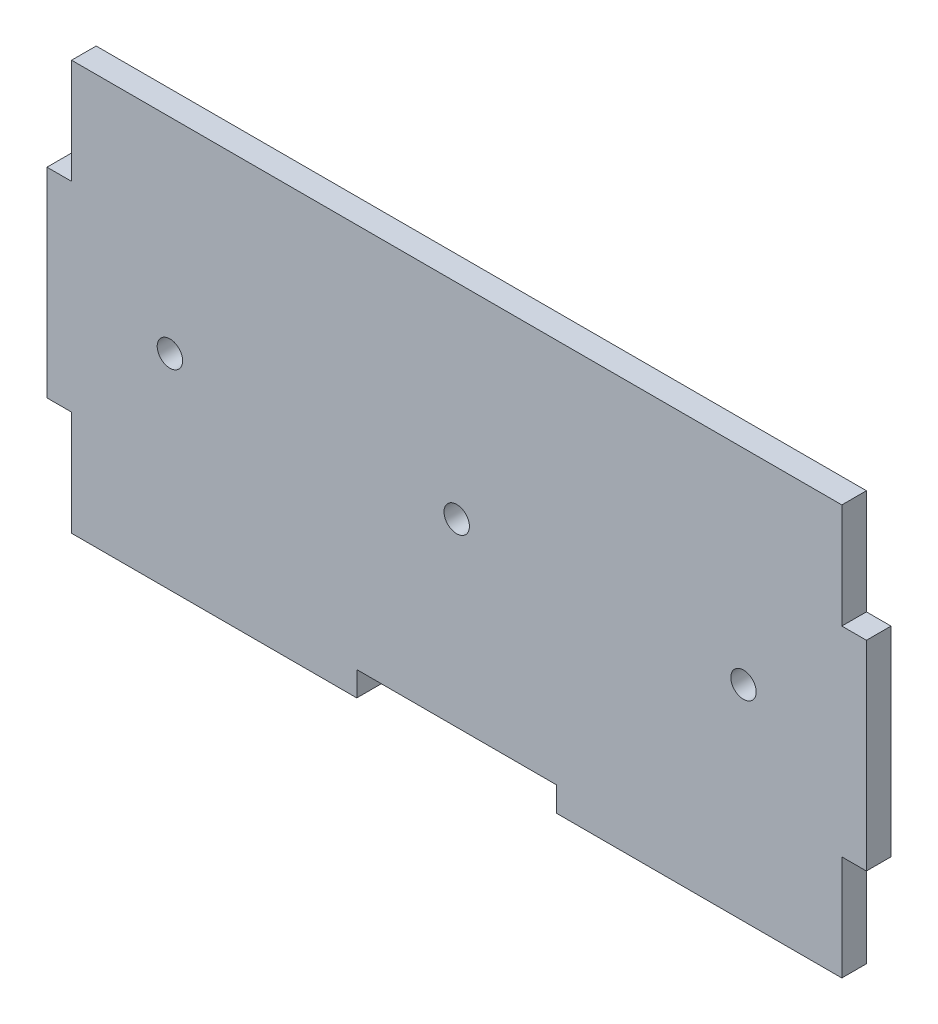
ISO-10303-21;
HEADER;
FILE_DESCRIPTION(('STEP AP214'),'2;1');
FILE_NAME('part.step','',(''),(''),'','','');
FILE_SCHEMA(('AUTOMOTIVE_DESIGN { 1 0 10303 214 1 1 1 1 }'));
ENDSEC;
DATA;
#1=APPLICATION_CONTEXT('core data for automotive mechanical design processes');
#2=APPLICATION_PROTOCOL_DEFINITION('international standard','automotive_design',2000,#1);
#3=PRODUCT_CONTEXT('',#1,'mechanical');
#4=PRODUCT('Part','Part','',(#3));
#5=PRODUCT_RELATED_PRODUCT_CATEGORY('part','',(#4));
#6=PRODUCT_DEFINITION_FORMATION('','',#4);
#7=PRODUCT_DEFINITION_CONTEXT('part definition',#1,'design');
#8=PRODUCT_DEFINITION('design','',#6,#7);
#9=PRODUCT_DEFINITION_SHAPE('','',#8);
#10=(LENGTH_UNIT() NAMED_UNIT(*) SI_UNIT(.MILLI.,.METRE.));
#11=(NAMED_UNIT(*) PLANE_ANGLE_UNIT() SI_UNIT($,.RADIAN.));
#12=(NAMED_UNIT(*) SI_UNIT($,.STERADIAN.) SOLID_ANGLE_UNIT());
#13=UNCERTAINTY_MEASURE_WITH_UNIT(LENGTH_MEASURE(1.E-05),#10,'distance_accuracy_value','');
#14=(GEOMETRIC_REPRESENTATION_CONTEXT(3) GLOBAL_UNCERTAINTY_ASSIGNED_CONTEXT((#13)) GLOBAL_UNIT_ASSIGNED_CONTEXT((#10,
#11,#12)) REPRESENTATION_CONTEXT('',''));
#15=CARTESIAN_POINT('',(0.,0.,0.));
#16=DIRECTION('',(0.,0.,1.));
#17=DIRECTION('',(1.,0.,0.));
#18=AXIS2_PLACEMENT_3D('',#15,#16,#17);
#19=CARTESIAN_POINT('',(280.,103.,3.));
#20=DIRECTION('',(0.,-1.,0.));
#21=DIRECTION('',(0.,0.,-1.));
#22=AXIS2_PLACEMENT_3D('',#19,#20,#21);
#23=PLANE('',#22);
#24=DIRECTION('',(-1.,0.,0.));
#25=VECTOR('',#24,1.);
#26=CARTESIAN_POINT('',(280.,103.,0.));
#27=LINE('',#26,#25);
#28=CARTESIAN_POINT('',(280.,103.,0.));
#29=VERTEX_POINT('',#28);
#30=CARTESIAN_POINT('',(186.,103.,0.));
#31=VERTEX_POINT('',#30);
#32=EDGE_CURVE('E178',#29,#31,#27,.T.);
#33=ORIENTED_EDGE('',*,*,#32,.T.);
#34=DIRECTION('',(0.,0.,-1.));
#35=VECTOR('',#34,1.);
#36=CARTESIAN_POINT('',(186.,103.,3.));
#37=LINE('',#36,#35);
#38=CARTESIAN_POINT('',(186.,103.,3.));
#39=VERTEX_POINT('',#38);
#40=EDGE_CURVE('E11',#39,#31,#37,.T.);
#41=ORIENTED_EDGE('',*,*,#40,.F.);
#42=DIRECTION('',(-1.,0.,0.));
#43=VECTOR('',#42,1.);
#44=CARTESIAN_POINT('',(280.,103.,3.));
#45=LINE('',#44,#43);
#46=CARTESIAN_POINT('',(280.,103.,3.));
#47=VERTEX_POINT('',#46);
#48=EDGE_CURVE('E209',#47,#39,#45,.T.);
#49=ORIENTED_EDGE('',*,*,#48,.F.);
#50=DIRECTION('',(0.,0.,-1.));
#51=VECTOR('',#50,1.);
#52=CARTESIAN_POINT('',(280.,103.,3.));
#53=LINE('',#52,#51);
#54=EDGE_CURVE('E174',#47,#29,#53,.T.);
#55=ORIENTED_EDGE('',*,*,#54,.T.);
#56=EDGE_LOOP('',(#33,#41,#49,#55));
#57=FACE_BOUND('',#56,.T.);
#58=ADVANCED_FACE('F32',(#57),#23,.F.);
#59=CARTESIAN_POINT('',(186.,103.,3.));
#60=DIRECTION('',(1.,0.,0.));
#61=DIRECTION('',(0.,0.,-1.));
#62=AXIS2_PLACEMENT_3D('',#59,#60,#61);
#63=PLANE('',#62);
#64=DIRECTION('',(0.,-1.,0.));
#65=VECTOR('',#64,1.);
#66=CARTESIAN_POINT('',(186.,103.,0.));
#67=LINE('',#66,#65);
#68=CARTESIAN_POINT('',(186.,90.195,0.));
#69=VERTEX_POINT('',#68);
#70=EDGE_CURVE('E181',#31,#69,#67,.T.);
#71=ORIENTED_EDGE('',*,*,#70,.T.);
#72=DIRECTION('',(0.,0.,-1.));
#73=VECTOR('',#72,1.);
#74=CARTESIAN_POINT('',(186.,90.195,3.));
#75=LINE('',#74,#73);
#76=CARTESIAN_POINT('',(186.,90.195,3.));
#77=VERTEX_POINT('',#76);
#78=EDGE_CURVE('E41',#77,#69,#75,.T.);
#79=ORIENTED_EDGE('',*,*,#78,.F.);
#80=DIRECTION('',(0.,-1.,0.));
#81=VECTOR('',#80,1.);
#82=CARTESIAN_POINT('',(186.,103.,3.));
#83=LINE('',#82,#81);
#84=EDGE_CURVE('E117',#39,#77,#83,.T.);
#85=ORIENTED_EDGE('',*,*,#84,.F.);
#86=ORIENTED_EDGE('',*,*,#40,.T.);
#87=EDGE_LOOP('',(#71,#79,#85,#86));
#88=FACE_BOUND('',#87,.T.);
#89=ADVANCED_FACE('F271',(#88),#63,.F.);
#90=CARTESIAN_POINT('',(186.,90.195,3.));
#91=DIRECTION('',(0.,-1.,0.));
#92=DIRECTION('',(0.,0.,-1.));
#93=AXIS2_PLACEMENT_3D('',#90,#91,#92);
#94=PLANE('',#93);
#95=DIRECTION('',(-1.,0.,0.));
#96=VECTOR('',#95,1.);
#97=CARTESIAN_POINT('',(186.,90.195,0.));
#98=LINE('',#97,#96);
#99=CARTESIAN_POINT('',(183.,90.195,0.));
#100=VERTEX_POINT('',#99);
#101=EDGE_CURVE('E183',#69,#100,#98,.T.);
#102=ORIENTED_EDGE('',*,*,#101,.T.);
#103=DIRECTION('',(0.,0.,-1.));
#104=VECTOR('',#103,1.);
#105=CARTESIAN_POINT('',(183.,90.195,3.));
#106=LINE('',#105,#104);
#107=CARTESIAN_POINT('',(183.,90.195,3.));
#108=VERTEX_POINT('',#107);
#109=EDGE_CURVE('E240',#108,#100,#106,.T.);
#110=ORIENTED_EDGE('',*,*,#109,.F.);
#111=DIRECTION('',(-1.,0.,0.));
#112=VECTOR('',#111,1.);
#113=CARTESIAN_POINT('',(186.,90.195,3.));
#114=LINE('',#113,#112);
#115=EDGE_CURVE('E286',#77,#108,#114,.T.);
#116=ORIENTED_EDGE('',*,*,#115,.F.);
#117=ORIENTED_EDGE('',*,*,#78,.T.);
#118=EDGE_LOOP('',(#102,#110,#116,#117));
#119=FACE_BOUND('',#118,.T.);
#120=ADVANCED_FACE('F276',(#119),#94,.F.);
#121=CARTESIAN_POINT('',(183.,90.195,3.));
#122=DIRECTION('',(1.,0.,0.));
#123=DIRECTION('',(0.,0.,-1.));
#124=AXIS2_PLACEMENT_3D('',#121,#122,#123);
#125=PLANE('',#124);
#126=DIRECTION('',(0.,-1.,0.));
#127=VECTOR('',#126,1.);
#128=CARTESIAN_POINT('',(183.,90.195,0.));
#129=LINE('',#128,#127);
#130=CARTESIAN_POINT('',(183.,65.805,0.));
#131=VERTEX_POINT('',#130);
#132=EDGE_CURVE('E185',#100,#131,#129,.T.);
#133=ORIENTED_EDGE('',*,*,#132,.T.);
#134=DIRECTION('',(0.,0.,-1.));
#135=VECTOR('',#134,1.);
#136=CARTESIAN_POINT('',(183.,65.805,3.));
#137=LINE('',#136,#135);
#138=CARTESIAN_POINT('',(183.,65.805,3.));
#139=VERTEX_POINT('',#138);
#140=EDGE_CURVE('E237',#139,#131,#137,.T.);
#141=ORIENTED_EDGE('',*,*,#140,.F.);
#142=DIRECTION('',(0.,-1.,0.));
#143=VECTOR('',#142,1.);
#144=CARTESIAN_POINT('',(183.,90.195,3.));
#145=LINE('',#144,#143);
#146=EDGE_CURVE('E288',#108,#139,#145,.T.);
#147=ORIENTED_EDGE('',*,*,#146,.F.);
#148=ORIENTED_EDGE('',*,*,#109,.T.);
#149=EDGE_LOOP('',(#133,#141,#147,#148));
#150=FACE_BOUND('',#149,.T.);
#151=ADVANCED_FACE('F357',(#150),#125,.F.);
#152=CARTESIAN_POINT('',(183.,65.805,3.));
#153=DIRECTION('',(0.,1.,0.));
#154=DIRECTION('',(0.,0.,1.));
#155=AXIS2_PLACEMENT_3D('',#152,#153,#154);
#156=PLANE('',#155);
#157=DIRECTION('',(1.,0.,0.));
#158=VECTOR('',#157,1.);
#159=CARTESIAN_POINT('',(183.,65.805,0.));
#160=LINE('',#159,#158);
#161=CARTESIAN_POINT('',(186.,65.805,0.));
#162=VERTEX_POINT('',#161);
#163=EDGE_CURVE('E187',#131,#162,#160,.T.);
#164=ORIENTED_EDGE('',*,*,#163,.T.);
#165=DIRECTION('',(0.,0.,-1.));
#166=VECTOR('',#165,1.);
#167=CARTESIAN_POINT('',(186.,65.805,3.));
#168=LINE('',#167,#166);
#169=CARTESIAN_POINT('',(186.,65.805,3.));
#170=VERTEX_POINT('',#169);
#171=EDGE_CURVE('E234',#170,#162,#168,.T.);
#172=ORIENTED_EDGE('',*,*,#171,.F.);
#173=DIRECTION('',(1.,0.,0.));
#174=VECTOR('',#173,1.);
#175=CARTESIAN_POINT('',(183.,65.805,3.));
#176=LINE('',#175,#174);
#177=EDGE_CURVE('E290',#139,#170,#176,.T.);
#178=ORIENTED_EDGE('',*,*,#177,.F.);
#179=ORIENTED_EDGE('',*,*,#140,.T.);
#180=EDGE_LOOP('',(#164,#172,#178,#179));
#181=FACE_BOUND('',#180,.T.);
#182=ADVANCED_FACE('F353',(#181),#156,.F.);
#183=CARTESIAN_POINT('',(186.,65.805,3.));
#184=DIRECTION('',(1.,0.,0.));
#185=DIRECTION('',(0.,0.,-1.));
#186=AXIS2_PLACEMENT_3D('',#183,#184,#185);
#187=PLANE('',#186);
#188=DIRECTION('',(0.,-1.,0.));
#189=VECTOR('',#188,1.);
#190=CARTESIAN_POINT('',(186.,65.805,0.));
#191=LINE('',#190,#189);
#192=CARTESIAN_POINT('',(186.,53.,0.));
#193=VERTEX_POINT('',#192);
#194=EDGE_CURVE('E189',#162,#193,#191,.T.);
#195=ORIENTED_EDGE('',*,*,#194,.T.);
#196=DIRECTION('',(0.,0.,-1.));
#197=VECTOR('',#196,1.);
#198=CARTESIAN_POINT('',(186.,53.,3.));
#199=LINE('',#198,#197);
#200=CARTESIAN_POINT('',(186.,53.,3.));
#201=VERTEX_POINT('',#200);
#202=EDGE_CURVE('E231',#201,#193,#199,.T.);
#203=ORIENTED_EDGE('',*,*,#202,.F.);
#204=DIRECTION('',(0.,-1.,0.));
#205=VECTOR('',#204,1.);
#206=CARTESIAN_POINT('',(186.,65.805,3.));
#207=LINE('',#206,#205);
#208=EDGE_CURVE('E296',#170,#201,#207,.T.);
#209=ORIENTED_EDGE('',*,*,#208,.F.);
#210=ORIENTED_EDGE('',*,*,#171,.T.);
#211=EDGE_LOOP('',(#195,#203,#209,#210));
#212=FACE_BOUND('',#211,.T.);
#213=ADVANCED_FACE('F349',(#212),#187,.F.);
#214=CARTESIAN_POINT('',(186.,53.,3.));
#215=DIRECTION('',(0.,1.,0.));
#216=DIRECTION('',(0.,0.,1.));
#217=AXIS2_PLACEMENT_3D('',#214,#215,#216);
#218=PLANE('',#217);
#219=DIRECTION('',(1.,0.,0.));
#220=VECTOR('',#219,1.);
#221=CARTESIAN_POINT('',(186.,53.,0.));
#222=LINE('',#221,#220);
#223=CARTESIAN_POINT('',(220.805,53.,0.));
#224=VERTEX_POINT('',#223);
#225=EDGE_CURVE('E191',#193,#224,#222,.T.);
#226=ORIENTED_EDGE('',*,*,#225,.T.);
#227=DIRECTION('',(0.,0.,-1.));
#228=VECTOR('',#227,1.);
#229=CARTESIAN_POINT('',(220.805,53.,3.));
#230=LINE('',#229,#228);
#231=CARTESIAN_POINT('',(220.805,53.,3.));
#232=VERTEX_POINT('',#231);
#233=EDGE_CURVE('E228',#232,#224,#230,.T.);
#234=ORIENTED_EDGE('',*,*,#233,.F.);
#235=DIRECTION('',(1.,0.,0.));
#236=VECTOR('',#235,1.);
#237=CARTESIAN_POINT('',(186.,53.,3.));
#238=LINE('',#237,#236);
#239=EDGE_CURVE('E298',#201,#232,#238,.T.);
#240=ORIENTED_EDGE('',*,*,#239,.F.);
#241=ORIENTED_EDGE('',*,*,#202,.T.);
#242=EDGE_LOOP('',(#226,#234,#240,#241));
#243=FACE_BOUND('',#242,.T.);
#244=ADVANCED_FACE('F345',(#243),#218,.F.);
#245=CARTESIAN_POINT('',(220.805,53.,3.));
#246=DIRECTION('',(-1.,0.,0.));
#247=DIRECTION('',(0.,0.,1.));
#248=AXIS2_PLACEMENT_3D('',#245,#246,#247);
#249=PLANE('',#248);
#250=DIRECTION('',(0.,1.,0.));
#251=VECTOR('',#250,1.);
#252=CARTESIAN_POINT('',(220.805,53.,0.));
#253=LINE('',#252,#251);
#254=CARTESIAN_POINT('',(220.805,56.,0.));
#255=VERTEX_POINT('',#254);
#256=EDGE_CURVE('E193',#224,#255,#253,.T.);
#257=ORIENTED_EDGE('',*,*,#256,.T.);
#258=DIRECTION('',(0.,0.,-1.));
#259=VECTOR('',#258,1.);
#260=CARTESIAN_POINT('',(220.805,56.,3.));
#261=LINE('',#260,#259);
#262=CARTESIAN_POINT('',(220.805,56.,3.));
#263=VERTEX_POINT('',#262);
#264=EDGE_CURVE('E225',#263,#255,#261,.T.);
#265=ORIENTED_EDGE('',*,*,#264,.F.);
#266=DIRECTION('',(0.,1.,0.));
#267=VECTOR('',#266,1.);
#268=CARTESIAN_POINT('',(220.805,53.,3.));
#269=LINE('',#268,#267);
#270=EDGE_CURVE('E300',#232,#263,#269,.T.);
#271=ORIENTED_EDGE('',*,*,#270,.F.);
#272=ORIENTED_EDGE('',*,*,#233,.T.);
#273=EDGE_LOOP('',(#257,#265,#271,#272));
#274=FACE_BOUND('',#273,.T.);
#275=ADVANCED_FACE('F341',(#274),#249,.F.);
#276=CARTESIAN_POINT('',(220.805,56.,3.));
#277=DIRECTION('',(0.,1.,0.));
#278=DIRECTION('',(0.,0.,1.));
#279=AXIS2_PLACEMENT_3D('',#276,#277,#278);
#280=PLANE('',#279);
#281=DIRECTION('',(1.,0.,0.));
#282=VECTOR('',#281,1.);
#283=CARTESIAN_POINT('',(220.805,56.,0.));
#284=LINE('',#283,#282);
#285=CARTESIAN_POINT('',(245.195,56.,0.));
#286=VERTEX_POINT('',#285);
#287=EDGE_CURVE('E195',#255,#286,#284,.T.);
#288=ORIENTED_EDGE('',*,*,#287,.T.);
#289=DIRECTION('',(0.,0.,-1.));
#290=VECTOR('',#289,1.);
#291=CARTESIAN_POINT('',(245.195,56.,3.));
#292=LINE('',#291,#290);
#293=CARTESIAN_POINT('',(245.195,56.,3.));
#294=VERTEX_POINT('',#293);
#295=EDGE_CURVE('E222',#294,#286,#292,.T.);
#296=ORIENTED_EDGE('',*,*,#295,.F.);
#297=DIRECTION('',(1.,0.,0.));
#298=VECTOR('',#297,1.);
#299=CARTESIAN_POINT('',(220.805,56.,3.));
#300=LINE('',#299,#298);
#301=EDGE_CURVE('E302',#263,#294,#300,.T.);
#302=ORIENTED_EDGE('',*,*,#301,.F.);
#303=ORIENTED_EDGE('',*,*,#264,.T.);
#304=EDGE_LOOP('',(#288,#296,#302,#303));
#305=FACE_BOUND('',#304,.T.);
#306=ADVANCED_FACE('F335',(#305),#280,.F.);
#307=CARTESIAN_POINT('',(245.195,56.,3.));
#308=DIRECTION('',(1.,0.,0.));
#309=DIRECTION('',(0.,0.,-1.));
#310=AXIS2_PLACEMENT_3D('',#307,#308,#309);
#311=PLANE('',#310);
#312=DIRECTION('',(0.,-1.,0.));
#313=VECTOR('',#312,1.);
#314=CARTESIAN_POINT('',(245.195,56.,0.));
#315=LINE('',#314,#313);
#316=CARTESIAN_POINT('',(245.195,53.,0.));
#317=VERTEX_POINT('',#316);
#318=EDGE_CURVE('E197',#286,#317,#315,.T.);
#319=ORIENTED_EDGE('',*,*,#318,.T.);
#320=DIRECTION('',(0.,0.,-1.));
#321=VECTOR('',#320,1.);
#322=CARTESIAN_POINT('',(245.195,53.,3.));
#323=LINE('',#322,#321);
#324=CARTESIAN_POINT('',(245.195,53.,3.));
#325=VERTEX_POINT('',#324);
#326=EDGE_CURVE('E219',#325,#317,#323,.T.);
#327=ORIENTED_EDGE('',*,*,#326,.F.);
#328=DIRECTION('',(0.,-1.,0.));
#329=VECTOR('',#328,1.);
#330=CARTESIAN_POINT('',(245.195,56.,3.));
#331=LINE('',#330,#329);
#332=EDGE_CURVE('E304',#294,#325,#331,.T.);
#333=ORIENTED_EDGE('',*,*,#332,.F.);
#334=ORIENTED_EDGE('',*,*,#295,.T.);
#335=EDGE_LOOP('',(#319,#327,#333,#334));
#336=FACE_BOUND('',#335,.T.);
#337=ADVANCED_FACE('F324',(#336),#311,.F.);
#338=CARTESIAN_POINT('',(269.585,53.,3.));
#339=DIRECTION('',(0.,1.,0.));
#340=DIRECTION('',(0.,0.,1.));
#341=AXIS2_PLACEMENT_3D('',#338,#339,#340);
#342=PLANE('',#341);
#343=DIRECTION('',(1.,0.,0.));
#344=VECTOR('',#343,1.);
#345=CARTESIAN_POINT('',(269.585,53.,0.));
#346=LINE('',#345,#344);
#347=CARTESIAN_POINT('',(280.,53.,0.));
#348=VERTEX_POINT('',#347);
#349=EDGE_CURVE('E200',#317,#348,#346,.T.);
#350=ORIENTED_EDGE('',*,*,#349,.T.);
#351=DIRECTION('',(0.,0.,-1.));
#352=VECTOR('',#351,1.);
#353=CARTESIAN_POINT('',(280.,53.,3.));
#354=LINE('',#353,#352);
#355=CARTESIAN_POINT('',(280.,53.,3.));
#356=VERTEX_POINT('',#355);
#357=EDGE_CURVE('E216',#356,#348,#354,.T.);
#358=ORIENTED_EDGE('',*,*,#357,.F.);
#359=DIRECTION('',(1.,0.,0.));
#360=VECTOR('',#359,1.);
#361=CARTESIAN_POINT('',(245.195,53.,3.));
#362=LINE('',#361,#360);
#363=EDGE_CURVE('E306',#325,#356,#362,.T.);
#364=ORIENTED_EDGE('',*,*,#363,.F.);
#365=ORIENTED_EDGE('',*,*,#326,.T.);
#366=EDGE_LOOP('',(#350,#358,#364,#365));
#367=FACE_BOUND('',#366,.T.);
#368=ADVANCED_FACE('F327',(#367),#342,.F.);
#369=CARTESIAN_POINT('',(280.,53.,3.));
#370=DIRECTION('',(-1.,0.,0.));
#371=DIRECTION('',(0.,0.,1.));
#372=AXIS2_PLACEMENT_3D('',#369,#370,#371);
#373=PLANE('',#372);
#374=DIRECTION('',(0.,1.,0.));
#375=VECTOR('',#374,1.);
#376=CARTESIAN_POINT('',(280.,53.,0.));
#377=LINE('',#376,#375);
#378=CARTESIAN_POINT('',(280.,65.805,0.));
#379=VERTEX_POINT('',#378);
#380=EDGE_CURVE('E202',#348,#379,#377,.T.);
#381=ORIENTED_EDGE('',*,*,#380,.T.);
#382=DIRECTION('',(0.,0.,-1.));
#383=VECTOR('',#382,1.);
#384=CARTESIAN_POINT('',(280.,65.805,3.));
#385=LINE('',#384,#383);
#386=CARTESIAN_POINT('',(280.,65.805,3.));
#387=VERTEX_POINT('',#386);
#388=EDGE_CURVE('E213',#387,#379,#385,.T.);
#389=ORIENTED_EDGE('',*,*,#388,.F.);
#390=DIRECTION('',(0.,1.,0.));
#391=VECTOR('',#390,1.);
#392=CARTESIAN_POINT('',(280.,53.,3.));
#393=LINE('',#392,#391);
#394=EDGE_CURVE('E308',#356,#387,#393,.T.);
#395=ORIENTED_EDGE('',*,*,#394,.F.);
#396=ORIENTED_EDGE('',*,*,#357,.T.);
#397=EDGE_LOOP('',(#381,#389,#395,#396));
#398=FACE_BOUND('',#397,.T.);
#399=ADVANCED_FACE('F314',(#398),#373,.F.);
#400=CARTESIAN_POINT('',(280.,65.805,3.));
#401=DIRECTION('',(0.,1.,0.));
#402=DIRECTION('',(0.,0.,1.));
#403=AXIS2_PLACEMENT_3D('',#400,#401,#402);
#404=PLANE('',#403);
#405=DIRECTION('',(1.,0.,0.));
#406=VECTOR('',#405,1.);
#407=CARTESIAN_POINT('',(280.,65.805,0.));
#408=LINE('',#407,#406);
#409=CARTESIAN_POINT('',(283.,65.805,0.));
#410=VERTEX_POINT('',#409);
#411=EDGE_CURVE('E204',#379,#410,#408,.T.);
#412=ORIENTED_EDGE('',*,*,#411,.T.);
#413=DIRECTION('',(0.,0.,-1.));
#414=VECTOR('',#413,1.);
#415=CARTESIAN_POINT('',(283.,65.805,3.));
#416=LINE('',#415,#414);
#417=CARTESIAN_POINT('',(283.,65.805,3.));
#418=VERTEX_POINT('',#417);
#419=EDGE_CURVE('E169',#418,#410,#416,.T.);
#420=ORIENTED_EDGE('',*,*,#419,.F.);
#421=DIRECTION('',(1.,0.,0.));
#422=VECTOR('',#421,1.);
#423=CARTESIAN_POINT('',(280.,65.805,3.));
#424=LINE('',#423,#422);
#425=EDGE_CURVE('E160',#387,#418,#424,.T.);
#426=ORIENTED_EDGE('',*,*,#425,.F.);
#427=ORIENTED_EDGE('',*,*,#388,.T.);
#428=EDGE_LOOP('',(#412,#420,#426,#427));
#429=FACE_BOUND('',#428,.T.);
#430=ADVANCED_FACE('F318',(#429),#404,.F.);
#431=CARTESIAN_POINT('',(283.,65.805,3.));
#432=DIRECTION('',(-1.,0.,0.));
#433=DIRECTION('',(0.,0.,1.));
#434=AXIS2_PLACEMENT_3D('',#431,#432,#433);
#435=PLANE('',#434);
#436=DIRECTION('',(0.,1.,0.));
#437=VECTOR('',#436,1.);
#438=CARTESIAN_POINT('',(283.,65.805,0.));
#439=LINE('',#438,#437);
#440=CARTESIAN_POINT('',(283.,90.195,0.));
#441=VERTEX_POINT('',#440);
#442=EDGE_CURVE('E168',#410,#441,#439,.T.);
#443=ORIENTED_EDGE('',*,*,#442,.T.);
#444=DIRECTION('',(0.,0.,-1.));
#445=VECTOR('',#444,1.);
#446=CARTESIAN_POINT('',(283.,90.195,3.));
#447=LINE('',#446,#445);
#448=CARTESIAN_POINT('',(283.,90.195,3.));
#449=VERTEX_POINT('',#448);
#450=EDGE_CURVE('E165',#449,#441,#447,.T.);
#451=ORIENTED_EDGE('',*,*,#450,.F.);
#452=DIRECTION('',(0.,1.,0.));
#453=VECTOR('',#452,1.);
#454=CARTESIAN_POINT('',(283.,65.805,3.));
#455=LINE('',#454,#453);
#456=EDGE_CURVE('E154',#418,#449,#455,.T.);
#457=ORIENTED_EDGE('',*,*,#456,.F.);
#458=ORIENTED_EDGE('',*,*,#419,.T.);
#459=EDGE_LOOP('',(#443,#451,#457,#458));
#460=FACE_BOUND('',#459,.T.);
#461=ADVANCED_FACE('F166',(#460),#435,.F.);
#462=CARTESIAN_POINT('',(283.,90.195,3.));
#463=DIRECTION('',(0.,-1.,0.));
#464=DIRECTION('',(0.,0.,-1.));
#465=AXIS2_PLACEMENT_3D('',#462,#463,#464);
#466=PLANE('',#465);
#467=DIRECTION('',(-1.,0.,0.));
#468=VECTOR('',#467,1.);
#469=CARTESIAN_POINT('',(283.,90.195,0.));
#470=LINE('',#469,#468);
#471=CARTESIAN_POINT('',(280.,90.195,0.));
#472=VERTEX_POINT('',#471);
#473=EDGE_CURVE('E103',#441,#472,#470,.T.);
#474=ORIENTED_EDGE('',*,*,#473,.T.);
#475=DIRECTION('',(0.,0.,-1.));
#476=VECTOR('',#475,1.);
#477=CARTESIAN_POINT('',(280.,90.195,3.));
#478=LINE('',#477,#476);
#479=CARTESIAN_POINT('',(280.,90.195,3.));
#480=VERTEX_POINT('',#479);
#481=EDGE_CURVE('E170',#480,#472,#478,.T.);
#482=ORIENTED_EDGE('',*,*,#481,.F.);
#483=DIRECTION('',(-1.,0.,0.));
#484=VECTOR('',#483,1.);
#485=CARTESIAN_POINT('',(283.,90.195,3.));
#486=LINE('',#485,#484);
#487=EDGE_CURVE('E158',#449,#480,#486,.T.);
#488=ORIENTED_EDGE('',*,*,#487,.F.);
#489=ORIENTED_EDGE('',*,*,#450,.T.);
#490=EDGE_LOOP('',(#474,#482,#488,#489));
#491=FACE_BOUND('',#490,.T.);
#492=ADVANCED_FACE('F172',(#491),#466,.F.);
#493=CARTESIAN_POINT('',(280.,90.195,3.));
#494=DIRECTION('',(-1.,0.,0.));
#495=DIRECTION('',(0.,0.,1.));
#496=AXIS2_PLACEMENT_3D('',#493,#494,#495);
#497=PLANE('',#496);
#498=DIRECTION('',(0.,1.,0.));
#499=VECTOR('',#498,1.);
#500=CARTESIAN_POINT('',(280.,90.195,0.));
#501=LINE('',#500,#499);
#502=EDGE_CURVE('E109',#472,#29,#501,.T.);
#503=ORIENTED_EDGE('',*,*,#502,.T.);
#504=ORIENTED_EDGE('',*,*,#54,.F.);
#505=DIRECTION('',(0.,1.,0.));
#506=VECTOR('',#505,1.);
#507=CARTESIAN_POINT('',(280.,90.195,3.));
#508=LINE('',#507,#506);
#509=EDGE_CURVE('E50',#480,#47,#508,.T.);
#510=ORIENTED_EDGE('',*,*,#509,.F.);
#511=ORIENTED_EDGE('',*,*,#481,.T.);
#512=EDGE_LOOP('',(#503,#504,#510,#511));
#513=FACE_BOUND('',#512,.T.);
#514=ADVANCED_FACE('F430',(#513),#497,.F.);
#515=CARTESIAN_POINT('',(0.,0.,3.));
#516=DIRECTION('',(0.,0.,1.));
#517=DIRECTION('',(1.,0.,0.));
#518=AXIS2_PLACEMENT_3D('',#515,#516,#517);
#519=PLANE('',#518);
#520=CARTESIAN_POINT('',(268.,78.,3.));
#521=DIRECTION('',(0.,0.,1.));
#522=DIRECTION('',(1.,0.,0.));
#523=AXIS2_PLACEMENT_3D('',#520,#521,#522);
#524=CIRCLE('',#523,1.54999999999999);
#525=CARTESIAN_POINT('',(269.55,78.,3.));
#526=VERTEX_POINT('',#525);
#527=EDGE_CURVE('E486',#526,#526,#524,.T.);
#528=ORIENTED_EDGE('',*,*,#527,.F.);
#529=EDGE_LOOP('',(#528));
#530=FACE_BOUND('',#529,.T.);
#531=CARTESIAN_POINT('',(198.,78.,3.));
#532=DIRECTION('',(0.,0.,1.));
#533=DIRECTION('',(1.,0.,0.));
#534=AXIS2_PLACEMENT_3D('',#531,#532,#533);
#535=CIRCLE('',#534,1.54999999999999);
#536=CARTESIAN_POINT('',(199.55,78.,3.));
#537=VERTEX_POINT('',#536);
#538=EDGE_CURVE('E483',#537,#537,#535,.T.);
#539=ORIENTED_EDGE('',*,*,#538,.F.);
#540=EDGE_LOOP('',(#539));
#541=FACE_BOUND('',#540,.T.);
#542=CARTESIAN_POINT('',(233.,78.,3.));
#543=DIRECTION('',(0.,0.,1.));
#544=DIRECTION('',(1.,0.,0.));
#545=AXIS2_PLACEMENT_3D('',#542,#543,#544);
#546=CIRCLE('',#545,1.54999999999999);
#547=CARTESIAN_POINT('',(234.55,78.,3.));
#548=VERTEX_POINT('',#547);
#549=EDGE_CURVE('E248',#548,#548,#546,.T.);
#550=ORIENTED_EDGE('',*,*,#549,.F.);
#551=EDGE_LOOP('',(#550));
#552=FACE_BOUND('',#551,.T.);
#553=ORIENTED_EDGE('',*,*,#48,.T.);
#554=ORIENTED_EDGE('',*,*,#84,.T.);
#555=ORIENTED_EDGE('',*,*,#115,.T.);
#556=ORIENTED_EDGE('',*,*,#146,.T.);
#557=ORIENTED_EDGE('',*,*,#177,.T.);
#558=ORIENTED_EDGE('',*,*,#208,.T.);
#559=ORIENTED_EDGE('',*,*,#239,.T.);
#560=ORIENTED_EDGE('',*,*,#270,.T.);
#561=ORIENTED_EDGE('',*,*,#301,.T.);
#562=ORIENTED_EDGE('',*,*,#332,.T.);
#563=ORIENTED_EDGE('',*,*,#363,.T.);
#564=ORIENTED_EDGE('',*,*,#394,.T.);
#565=ORIENTED_EDGE('',*,*,#425,.T.);
#566=ORIENTED_EDGE('',*,*,#456,.T.);
#567=ORIENTED_EDGE('',*,*,#487,.T.);
#568=ORIENTED_EDGE('',*,*,#509,.T.);
#569=EDGE_LOOP('',(#553,#554,#555,#556,#557,#558,#559,#560,#561,#562,#563,#564,#565,#566,#567,#568));
#570=FACE_BOUND('',#569,.T.);
#571=ADVANCED_FACE('F156',(#530,#541,#552,#570),#519,.T.);
#572=CARTESIAN_POINT('',(0.,0.,0.));
#573=DIRECTION('',(0.,0.,1.));
#574=DIRECTION('',(1.,0.,0.));
#575=AXIS2_PLACEMENT_3D('',#572,#573,#574);
#576=PLANE('',#575);
#577=CARTESIAN_POINT('',(268.,78.,0.));
#578=DIRECTION('',(0.,0.,1.));
#579=DIRECTION('',(1.,0.,0.));
#580=AXIS2_PLACEMENT_3D('',#577,#578,#579);
#581=CIRCLE('',#580,1.54999999999999);
#582=CARTESIAN_POINT('',(269.55,78.,0.));
#583=VERTEX_POINT('',#582);
#584=EDGE_CURVE('E35',#583,#583,#581,.T.);
#585=ORIENTED_EDGE('',*,*,#584,.T.);
#586=EDGE_LOOP('',(#585));
#587=FACE_BOUND('',#586,.T.);
#588=CARTESIAN_POINT('',(198.,78.,0.));
#589=DIRECTION('',(0.,0.,1.));
#590=DIRECTION('',(1.,0.,0.));
#591=AXIS2_PLACEMENT_3D('',#588,#589,#590);
#592=CIRCLE('',#591,1.54999999999999);
#593=CARTESIAN_POINT('',(199.55,78.,0.));
#594=VERTEX_POINT('',#593);
#595=EDGE_CURVE('E247',#594,#594,#592,.T.);
#596=ORIENTED_EDGE('',*,*,#595,.T.);
#597=EDGE_LOOP('',(#596));
#598=FACE_BOUND('',#597,.T.);
#599=CARTESIAN_POINT('',(233.,78.,0.));
#600=DIRECTION('',(0.,0.,1.));
#601=DIRECTION('',(1.,0.,0.));
#602=AXIS2_PLACEMENT_3D('',#599,#600,#601);
#603=CIRCLE('',#602,1.54999999999999);
#604=CARTESIAN_POINT('',(234.55,78.,0.));
#605=VERTEX_POINT('',#604);
#606=EDGE_CURVE('E245',#605,#605,#603,.T.);
#607=ORIENTED_EDGE('',*,*,#606,.T.);
#608=EDGE_LOOP('',(#607));
#609=FACE_BOUND('',#608,.T.);
#610=ORIENTED_EDGE('',*,*,#32,.F.);
#611=ORIENTED_EDGE('',*,*,#502,.F.);
#612=ORIENTED_EDGE('',*,*,#473,.F.);
#613=ORIENTED_EDGE('',*,*,#442,.F.);
#614=ORIENTED_EDGE('',*,*,#411,.F.);
#615=ORIENTED_EDGE('',*,*,#380,.F.);
#616=ORIENTED_EDGE('',*,*,#349,.F.);
#617=ORIENTED_EDGE('',*,*,#318,.F.);
#618=ORIENTED_EDGE('',*,*,#287,.F.);
#619=ORIENTED_EDGE('',*,*,#256,.F.);
#620=ORIENTED_EDGE('',*,*,#225,.F.);
#621=ORIENTED_EDGE('',*,*,#194,.F.);
#622=ORIENTED_EDGE('',*,*,#163,.F.);
#623=ORIENTED_EDGE('',*,*,#132,.F.);
#624=ORIENTED_EDGE('',*,*,#101,.F.);
#625=ORIENTED_EDGE('',*,*,#70,.F.);
#626=EDGE_LOOP('',(#610,#611,#612,#613,#614,#615,#616,#617,#618,#619,#620,#621,#622,#623,#624,#625));
#627=FACE_BOUND('',#626,.T.);
#628=ADVANCED_FACE('F255',(#587,#598,#609,#627),#576,.F.);
#629=CARTESIAN_POINT('',(233.,78.,-7.));
#630=DIRECTION('',(0.,0.,1.));
#631=DIRECTION('',(1.,0.,0.));
#632=AXIS2_PLACEMENT_3D('',#629,#630,#631);
#633=CYLINDRICAL_SURFACE('',#632,1.54999999999999);
#634=ORIENTED_EDGE('',*,*,#549,.T.);
#635=EDGE_LOOP('',(#634));
#636=FACE_BOUND('',#635,.T.);
#637=ORIENTED_EDGE('',*,*,#606,.F.);
#638=EDGE_LOOP('',(#637));
#639=FACE_BOUND('',#638,.T.);
#640=ADVANCED_FACE('F265',(#636,#639),#633,.F.);
#641=CARTESIAN_POINT('',(198.,78.,-7.));
#642=DIRECTION('',(0.,0.,1.));
#643=DIRECTION('',(1.,0.,0.));
#644=AXIS2_PLACEMENT_3D('',#641,#642,#643);
#645=CYLINDRICAL_SURFACE('',#644,1.54999999999999);
#646=ORIENTED_EDGE('',*,*,#538,.T.);
#647=EDGE_LOOP('',(#646));
#648=FACE_BOUND('',#647,.T.);
#649=ORIENTED_EDGE('',*,*,#595,.F.);
#650=EDGE_LOOP('',(#649));
#651=FACE_BOUND('',#650,.T.);
#652=ADVANCED_FACE('F259',(#648,#651),#645,.F.);
#653=CARTESIAN_POINT('',(268.,78.,-7.));
#654=DIRECTION('',(0.,0.,1.));
#655=DIRECTION('',(1.,0.,0.));
#656=AXIS2_PLACEMENT_3D('',#653,#654,#655);
#657=CYLINDRICAL_SURFACE('',#656,1.54999999999999);
#658=ORIENTED_EDGE('',*,*,#527,.T.);
#659=EDGE_LOOP('',(#658));
#660=FACE_BOUND('',#659,.T.);
#661=ORIENTED_EDGE('',*,*,#584,.F.);
#662=EDGE_LOOP('',(#661));
#663=FACE_BOUND('',#662,.T.);
#664=ADVANCED_FACE('F257',(#660,#663),#657,.F.);
#665=CLOSED_SHELL('',(#58,#89,#120,#151,#182,#213,#244,#275,#306,#337,#368,#399,#430,#461,#492,
#514,#571,#628,#640,#652,#664));
#666=MANIFOLD_SOLID_BREP('B2',#665);
#667=ADVANCED_BREP_SHAPE_REPRESENTATION('',(#18,#666),#14);
#668=SHAPE_DEFINITION_REPRESENTATION(#9,#667);
ENDSEC;
END-ISO-10303-21;
